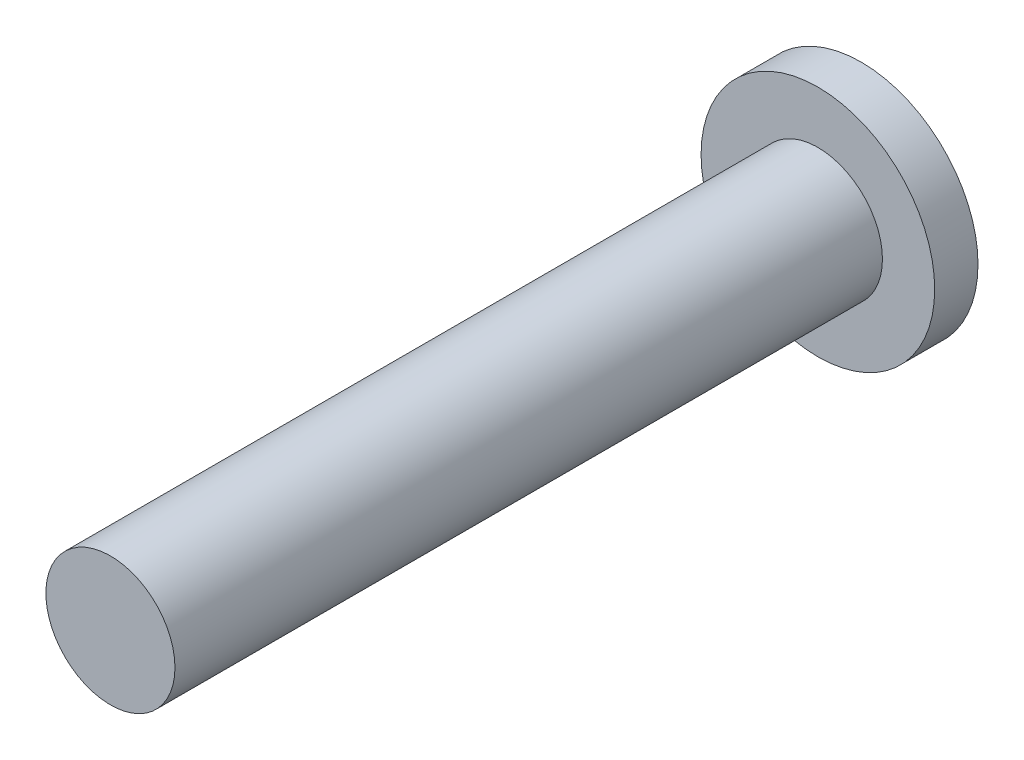
ISO-10303-21;
HEADER;
FILE_DESCRIPTION(('STEP AP214'),'2;1');
FILE_NAME('part.step','',(''),(''),'','','');
FILE_SCHEMA(('AUTOMOTIVE_DESIGN { 1 0 10303 214 1 1 1 1 }'));
ENDSEC;
DATA;
#1=APPLICATION_CONTEXT('core data for automotive mechanical design processes');
#2=APPLICATION_PROTOCOL_DEFINITION('international standard','automotive_design',2000,#1);
#3=PRODUCT_CONTEXT('',#1,'mechanical');
#4=PRODUCT('Part','Part','',(#3));
#5=PRODUCT_RELATED_PRODUCT_CATEGORY('part','',(#4));
#6=PRODUCT_DEFINITION_FORMATION('','',#4);
#7=PRODUCT_DEFINITION_CONTEXT('part definition',#1,'design');
#8=PRODUCT_DEFINITION('design','',#6,#7);
#9=PRODUCT_DEFINITION_SHAPE('','',#8);
#10=(LENGTH_UNIT() NAMED_UNIT(*) SI_UNIT(.MILLI.,.METRE.));
#11=(NAMED_UNIT(*) PLANE_ANGLE_UNIT() SI_UNIT($,.RADIAN.));
#12=(NAMED_UNIT(*) SI_UNIT($,.STERADIAN.) SOLID_ANGLE_UNIT());
#13=UNCERTAINTY_MEASURE_WITH_UNIT(LENGTH_MEASURE(1.E-05),#10,'distance_accuracy_value','');
#14=(GEOMETRIC_REPRESENTATION_CONTEXT(3) GLOBAL_UNCERTAINTY_ASSIGNED_CONTEXT((#13)) GLOBAL_UNIT_ASSIGNED_CONTEXT((#10,
#11,#12)) REPRESENTATION_CONTEXT('',''));
#15=CARTESIAN_POINT('',(0.,0.,0.));
#16=DIRECTION('',(0.,0.,1.));
#17=DIRECTION('',(1.,0.,0.));
#18=AXIS2_PLACEMENT_3D('',#15,#16,#17);
#19=CARTESIAN_POINT('',(0.,0.,1.64));
#20=DIRECTION('',(0.,0.,-1.));
#21=DIRECTION('',(-1.,0.,0.));
#22=AXIS2_PLACEMENT_3D('',#19,#20,#21);
#23=CYLINDRICAL_SURFACE('',#22,4.425);
#24=CARTESIAN_POINT('',(0.,0.,1.64));
#25=DIRECTION('',(0.,0.,1.));
#26=DIRECTION('',(1.,0.,0.));
#27=AXIS2_PLACEMENT_3D('',#24,#25,#26);
#28=CIRCLE('',#27,4.425);
#29=CARTESIAN_POINT('',(4.425,0.,1.64));
#30=VERTEX_POINT('',#29);
#31=EDGE_CURVE('E45',#30,#30,#28,.T.);
#32=ORIENTED_EDGE('',*,*,#31,.F.);
#33=EDGE_LOOP('',(#32));
#34=FACE_BOUND('',#33,.T.);
#35=CARTESIAN_POINT('',(0.,0.,0.));
#36=DIRECTION('',(0.,0.,1.));
#37=DIRECTION('',(1.,0.,0.));
#38=AXIS2_PLACEMENT_3D('',#35,#36,#37);
#39=CIRCLE('',#38,4.425);
#40=CARTESIAN_POINT('',(4.425,0.,0.));
#41=VERTEX_POINT('',#40);
#42=EDGE_CURVE('E40',#41,#41,#39,.T.);
#43=ORIENTED_EDGE('',*,*,#42,.T.);
#44=EDGE_LOOP('',(#43));
#45=FACE_BOUND('',#44,.T.);
#46=ADVANCED_FACE('F37',(#34,#45),#23,.T.);
#47=CARTESIAN_POINT('',(0.,0.,1.64));
#48=DIRECTION('',(0.,0.,1.));
#49=DIRECTION('',(1.,0.,0.));
#50=AXIS2_PLACEMENT_3D('',#47,#48,#49);
#51=PLANE('',#50);
#52=CARTESIAN_POINT('',(0.,0.,1.64));
#53=DIRECTION('',(0.,0.,1.));
#54=DIRECTION('',(1.,0.,0.));
#55=AXIS2_PLACEMENT_3D('',#52,#53,#54);
#56=CIRCLE('',#55,2.445);
#57=CARTESIAN_POINT('',(2.445,0.,1.64));
#58=VERTEX_POINT('',#57);
#59=EDGE_CURVE('E10',#58,#58,#56,.T.);
#60=ORIENTED_EDGE('',*,*,#59,.F.);
#61=EDGE_LOOP('',(#60));
#62=FACE_BOUND('',#61,.T.);
#63=ORIENTED_EDGE('',*,*,#31,.T.);
#64=EDGE_LOOP('',(#63));
#65=FACE_BOUND('',#64,.T.);
#66=ADVANCED_FACE('F65',(#62,#65),#51,.T.);
#67=CARTESIAN_POINT('',(0.,0.,0.));
#68=DIRECTION('',(0.,0.,1.));
#69=DIRECTION('',(1.,0.,0.));
#70=AXIS2_PLACEMENT_3D('',#67,#68,#69);
#71=PLANE('',#70);
#72=ORIENTED_EDGE('',*,*,#42,.F.);
#73=EDGE_LOOP('',(#72));
#74=FACE_BOUND('',#73,.T.);
#75=ADVANCED_FACE('F62',(#74),#71,.F.);
#76=CARTESIAN_POINT('',(0.,0.,28.44));
#77=DIRECTION('',(0.,0.,-1.));
#78=DIRECTION('',(-1.,0.,0.));
#79=AXIS2_PLACEMENT_3D('',#76,#77,#78);
#80=CYLINDRICAL_SURFACE('',#79,2.445);
#81=CARTESIAN_POINT('',(0.,0.,28.44));
#82=DIRECTION('',(0.,0.,1.));
#83=DIRECTION('',(1.,0.,0.));
#84=AXIS2_PLACEMENT_3D('',#81,#82,#83);
#85=CIRCLE('',#84,2.445);
#86=CARTESIAN_POINT('',(2.445,0.,28.44));
#87=VERTEX_POINT('',#86);
#88=EDGE_CURVE('E52',#87,#87,#85,.T.);
#89=ORIENTED_EDGE('',*,*,#88,.F.);
#90=EDGE_LOOP('',(#89));
#91=FACE_BOUND('',#90,.T.);
#92=ORIENTED_EDGE('',*,*,#59,.T.);
#93=EDGE_LOOP('',(#92));
#94=FACE_BOUND('',#93,.T.);
#95=ADVANCED_FACE('F64',(#91,#94),#80,.T.);
#96=CARTESIAN_POINT('',(0.,0.,28.44));
#97=DIRECTION('',(0.,0.,1.));
#98=DIRECTION('',(1.,0.,0.));
#99=AXIS2_PLACEMENT_3D('',#96,#97,#98);
#100=PLANE('',#99);
#101=ORIENTED_EDGE('',*,*,#88,.T.);
#102=EDGE_LOOP('',(#101));
#103=FACE_BOUND('',#102,.T.);
#104=ADVANCED_FACE('F70',(#103),#100,.T.);
#105=CLOSED_SHELL('',(#46,#66,#75,#95,#104));
#106=MANIFOLD_SOLID_BREP('B2',#105);
#107=ADVANCED_BREP_SHAPE_REPRESENTATION('',(#18,#106),#14);
#108=SHAPE_DEFINITION_REPRESENTATION(#9,#107);
ENDSEC;
END-ISO-10303-21;
